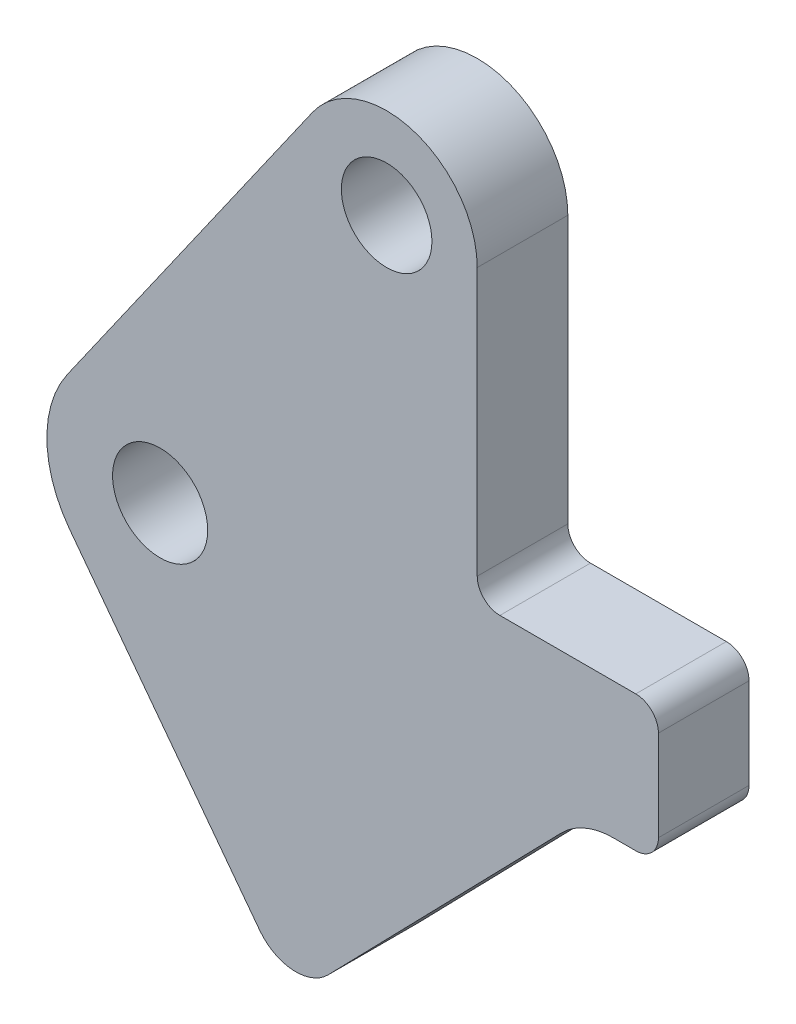
ISO-10303-21;
HEADER;
FILE_DESCRIPTION(('STEP AP214'),'2;1');
FILE_NAME('part.step','',(''),(''),'','','');
FILE_SCHEMA(('AUTOMOTIVE_DESIGN { 1 0 10303 214 1 1 1 1 }'));
ENDSEC;
DATA;
#1=APPLICATION_CONTEXT('core data for automotive mechanical design processes');
#2=APPLICATION_PROTOCOL_DEFINITION('international standard','automotive_design',2000,#1);
#3=PRODUCT_CONTEXT('',#1,'mechanical');
#4=PRODUCT('Part','Part','',(#3));
#5=PRODUCT_RELATED_PRODUCT_CATEGORY('part','',(#4));
#6=PRODUCT_DEFINITION_FORMATION('','',#4);
#7=PRODUCT_DEFINITION_CONTEXT('part definition',#1,'design');
#8=PRODUCT_DEFINITION('design','',#6,#7);
#9=PRODUCT_DEFINITION_SHAPE('','',#8);
#10=(LENGTH_UNIT() NAMED_UNIT(*) SI_UNIT(.MILLI.,.METRE.));
#11=(NAMED_UNIT(*) PLANE_ANGLE_UNIT() SI_UNIT($,.RADIAN.));
#12=(NAMED_UNIT(*) SI_UNIT($,.STERADIAN.) SOLID_ANGLE_UNIT());
#13=UNCERTAINTY_MEASURE_WITH_UNIT(LENGTH_MEASURE(1.E-05),#10,'distance_accuracy_value','');
#14=(GEOMETRIC_REPRESENTATION_CONTEXT(3) GLOBAL_UNCERTAINTY_ASSIGNED_CONTEXT((#13)) GLOBAL_UNIT_ASSIGNED_CONTEXT((#10,
#11,#12)) REPRESENTATION_CONTEXT('',''));
#15=CARTESIAN_POINT('',(0.,0.,0.));
#16=DIRECTION('',(0.,0.,1.));
#17=DIRECTION('',(1.,0.,0.));
#18=AXIS2_PLACEMENT_3D('',#15,#16,#17);
#19=CARTESIAN_POINT('',(0.,0.,2.));
#20=DIRECTION('',(0.,0.,1.));
#21=DIRECTION('',(1.,0.,0.));
#22=AXIS2_PLACEMENT_3D('',#19,#20,#21);
#23=PLANE('',#22);
#24=CARTESIAN_POINT('',(0.,0.,2.));
#25=DIRECTION('',(0.,0.,1.));
#26=DIRECTION('',(1.,0.,0.));
#27=AXIS2_PLACEMENT_3D('',#24,#25,#26);
#28=CIRCLE('',#27,1.05);
#29=CARTESIAN_POINT('',(1.05,0.,2.));
#30=VERTEX_POINT('',#29);
#31=EDGE_CURVE('E171',#30,#30,#28,.T.);
#32=ORIENTED_EDGE('',*,*,#31,.F.);
#33=EDGE_LOOP('',(#32));
#34=FACE_BOUND('',#33,.T.);
#35=CARTESIAN_POINT('',(0.,0.,2.));
#36=DIRECTION('',(0.,0.,1.));
#37=DIRECTION('',(1.,0.,0.));
#38=AXIS2_PLACEMENT_3D('',#35,#36,#37);
#39=CIRCLE('',#38,2.5);
#40=CARTESIAN_POINT('',(-2.04679142487829,1.43549464054893,2.));
#41=VERTEX_POINT('',#40);
#42=CARTESIAN_POINT('',(-1.99658877511824,-1.50453755788012,2.));
#43=VERTEX_POINT('',#42);
#44=EDGE_CURVE('E194',#41,#43,#39,.T.);
#45=ORIENTED_EDGE('',*,*,#44,.T.);
#46=DIRECTION('',(0.601815023152047,-0.798635510047294,0.));
#47=VECTOR('',#46,1.);
#48=CARTESIAN_POINT('',(-1.99658877511824,-1.50453755788012,2.));
#49=LINE('',#48,#47);
#50=CARTESIAN_POINT('',(2.1964101178715,-7.06883502588228,2.));
#51=VERTEX_POINT('',#50);
#52=EDGE_CURVE('E112',#43,#51,#49,.T.);
#53=ORIENTED_EDGE('',*,*,#52,.T.);
#54=CARTESIAN_POINT('',(2.99504562791879,-6.46702000273023,2.));
#55=DIRECTION('',(0.,0.,1.));
#56=DIRECTION('',(1.,0.,0.));
#57=AXIS2_PLACEMENT_3D('',#54,#55,#56);
#58=CIRCLE('',#57,1.);
#59=CARTESIAN_POINT('',(3.71149817182193,-7.16465583347198,2.));
#60=VERTEX_POINT('',#59);
#61=EDGE_CURVE('E227',#51,#60,#58,.T.);
#62=ORIENTED_EDGE('',*,*,#61,.T.);
#63=DIRECTION('',(0.697635830741747,0.716452543903134,0.));
#64=VECTOR('',#63,1.);
#65=CARTESIAN_POINT('',(3.71149817182193,-7.16465583347198,2.));
#66=LINE('',#65,#64);
#67=CARTESIAN_POINT('',(8.85367592975498,-1.8837826708132,2.));
#68=VERTEX_POINT('',#67);
#69=EDGE_CURVE('E246',#60,#68,#66,.T.);
#70=ORIENTED_EDGE('',*,*,#69,.T.);
#71=CARTESIAN_POINT('',(10.,-3.,2.));
#72=DIRECTION('',(0.,0.,-1.));
#73=DIRECTION('',(1.,0.,0.));
#74=AXIS2_PLACEMENT_3D('',#71,#72,#73);
#75=CIRCLE('',#74,1.6);
#76=CARTESIAN_POINT('',(10.,-1.4,2.));
#77=VERTEX_POINT('',#76);
#78=EDGE_CURVE('E243',#68,#77,#75,.T.);
#79=ORIENTED_EDGE('',*,*,#78,.T.);
#80=DIRECTION('',(1.,0.,0.));
#81=VECTOR('',#80,1.);
#82=CARTESIAN_POINT('',(10.,-1.4,2.));
#83=LINE('',#82,#81);
#84=CARTESIAN_POINT('',(10.5,-1.4,2.));
#85=VERTEX_POINT('',#84);
#86=EDGE_CURVE('E245',#77,#85,#83,.T.);
#87=ORIENTED_EDGE('',*,*,#86,.T.);
#88=CARTESIAN_POINT('',(10.5,-0.9,2.));
#89=DIRECTION('',(0.,0.,1.));
#90=DIRECTION('',(1.,0.,0.));
#91=AXIS2_PLACEMENT_3D('',#88,#89,#90);
#92=CIRCLE('',#91,0.5);
#93=CARTESIAN_POINT('',(11.,-0.9,2.));
#94=VERTEX_POINT('',#93);
#95=EDGE_CURVE('E248',#85,#94,#92,.T.);
#96=ORIENTED_EDGE('',*,*,#95,.T.);
#97=DIRECTION('',(0.,1.,0.));
#98=VECTOR('',#97,1.);
#99=CARTESIAN_POINT('',(11.,-0.9,2.));
#100=LINE('',#99,#98);
#101=CARTESIAN_POINT('',(11.,1.1,2.));
#102=VERTEX_POINT('',#101);
#103=EDGE_CURVE('E254',#94,#102,#100,.T.);
#104=ORIENTED_EDGE('',*,*,#103,.T.);
#105=CARTESIAN_POINT('',(10.5,1.1,2.));
#106=DIRECTION('',(0.,0.,1.));
#107=DIRECTION('',(1.,0.,0.));
#108=AXIS2_PLACEMENT_3D('',#105,#106,#107);
#109=CIRCLE('',#108,0.5);
#110=CARTESIAN_POINT('',(10.5,1.6,2.));
#111=VERTEX_POINT('',#110);
#112=EDGE_CURVE('E256',#102,#111,#109,.T.);
#113=ORIENTED_EDGE('',*,*,#112,.T.);
#114=DIRECTION('',(-1.,0.,0.));
#115=VECTOR('',#114,1.);
#116=CARTESIAN_POINT('',(7.5,1.6,2.));
#117=LINE('',#116,#115);
#118=CARTESIAN_POINT('',(7.5,1.6,2.));
#119=VERTEX_POINT('',#118);
#120=EDGE_CURVE('E258',#111,#119,#117,.T.);
#121=ORIENTED_EDGE('',*,*,#120,.T.);
#122=CARTESIAN_POINT('',(7.5,2.1,2.));
#123=DIRECTION('',(0.,0.,-1.));
#124=DIRECTION('',(1.,0.,0.));
#125=AXIS2_PLACEMENT_3D('',#122,#123,#124);
#126=CIRCLE('',#125,0.5);
#127=CARTESIAN_POINT('',(7.,2.1,2.));
#128=VERTEX_POINT('',#127);
#129=EDGE_CURVE('E149',#119,#128,#126,.T.);
#130=ORIENTED_EDGE('',*,*,#129,.T.);
#131=DIRECTION('',(0.,1.,0.));
#132=VECTOR('',#131,1.);
#133=CARTESIAN_POINT('',(7.,8.,2.));
#134=LINE('',#133,#132);
#135=CARTESIAN_POINT('',(7.,8.,2.));
#136=VERTEX_POINT('',#135);
#137=EDGE_CURVE('E143',#128,#136,#134,.T.);
#138=ORIENTED_EDGE('',*,*,#137,.T.);
#139=CARTESIAN_POINT('',(5.,8.,2.));
#140=DIRECTION('',(0.,0.,1.));
#141=DIRECTION('',(-1.,0.,0.));
#142=AXIS2_PLACEMENT_3D('',#139,#140,#141);
#143=CIRCLE('',#142,2.);
#144=CARTESIAN_POINT('',(3.36256686009737,9.14839571243914,2.));
#145=VERTEX_POINT('',#144);
#146=EDGE_CURVE('E147',#136,#145,#143,.T.);
#147=ORIENTED_EDGE('',*,*,#146,.T.);
#148=DIRECTION('',(-0.574197856219572,-0.818716569951315,0.));
#149=VECTOR('',#148,1.);
#150=CARTESIAN_POINT('',(3.36256686009737,9.14839571243914,2.));
#151=LINE('',#150,#149);
#152=EDGE_CURVE('E51',#145,#41,#151,.T.);
#153=ORIENTED_EDGE('',*,*,#152,.T.);
#154=EDGE_LOOP('',(#45,#53,#62,#70,#79,#87,#96,#104,#113,#121,#130,#138,#147,#153));
#155=FACE_BOUND('',#154,.T.);
#156=CARTESIAN_POINT('',(5.,8.,2.));
#157=DIRECTION('',(0.,0.,1.));
#158=DIRECTION('',(1.,0.,0.));
#159=AXIS2_PLACEMENT_3D('',#156,#157,#158);
#160=CIRCLE('',#159,1.);
#161=CARTESIAN_POINT('',(6.,8.,2.));
#162=VERTEX_POINT('',#161);
#163=EDGE_CURVE('E300',#162,#162,#160,.T.);
#164=ORIENTED_EDGE('',*,*,#163,.F.);
#165=EDGE_LOOP('',(#164));
#166=FACE_BOUND('',#165,.T.);
#167=ADVANCED_FACE('F34',(#34,#155,#166),#23,.T.);
#168=CARTESIAN_POINT('',(0.,0.,0.));
#169=DIRECTION('',(0.,0.,1.));
#170=DIRECTION('',(1.,0.,0.));
#171=AXIS2_PLACEMENT_3D('',#168,#169,#170);
#172=PLANE('',#171);
#173=CARTESIAN_POINT('',(0.,0.,0.));
#174=DIRECTION('',(0.,0.,1.));
#175=DIRECTION('',(1.,0.,0.));
#176=AXIS2_PLACEMENT_3D('',#173,#174,#175);
#177=CIRCLE('',#176,2.5);
#178=CARTESIAN_POINT('',(-2.04679142487829,1.43549464054893,0.));
#179=VERTEX_POINT('',#178);
#180=CARTESIAN_POINT('',(-1.99658877511824,-1.50453755788012,0.));
#181=VERTEX_POINT('',#180);
#182=EDGE_CURVE('E167',#179,#181,#177,.T.);
#183=ORIENTED_EDGE('',*,*,#182,.F.);
#184=DIRECTION('',(-0.574197856219572,-0.818716569951315,0.));
#185=VECTOR('',#184,1.);
#186=CARTESIAN_POINT('',(3.36256686009737,9.14839571243914,0.));
#187=LINE('',#186,#185);
#188=CARTESIAN_POINT('',(3.36256686009737,9.14839571243914,0.));
#189=VERTEX_POINT('',#188);
#190=EDGE_CURVE('E104',#189,#179,#187,.T.);
#191=ORIENTED_EDGE('',*,*,#190,.F.);
#192=CARTESIAN_POINT('',(5.,8.,0.));
#193=DIRECTION('',(0.,0.,1.));
#194=DIRECTION('',(-1.,0.,0.));
#195=AXIS2_PLACEMENT_3D('',#192,#193,#194);
#196=CIRCLE('',#195,2.);
#197=CARTESIAN_POINT('',(7.,8.,0.));
#198=VERTEX_POINT('',#197);
#199=EDGE_CURVE('E98',#198,#189,#196,.T.);
#200=ORIENTED_EDGE('',*,*,#199,.F.);
#201=DIRECTION('',(0.,1.,0.));
#202=VECTOR('',#201,1.);
#203=CARTESIAN_POINT('',(7.,8.,0.));
#204=LINE('',#203,#202);
#205=CARTESIAN_POINT('',(7.,2.1,0.));
#206=VERTEX_POINT('',#205);
#207=EDGE_CURVE('E157',#206,#198,#204,.T.);
#208=ORIENTED_EDGE('',*,*,#207,.F.);
#209=CARTESIAN_POINT('',(7.5,2.1,0.));
#210=DIRECTION('',(0.,0.,-1.));
#211=DIRECTION('',(1.,0.,0.));
#212=AXIS2_PLACEMENT_3D('',#209,#210,#211);
#213=CIRCLE('',#212,0.5);
#214=CARTESIAN_POINT('',(7.5,1.6,0.));
#215=VERTEX_POINT('',#214);
#216=EDGE_CURVE('E189',#215,#206,#213,.T.);
#217=ORIENTED_EDGE('',*,*,#216,.F.);
#218=DIRECTION('',(-1.,0.,0.));
#219=VECTOR('',#218,1.);
#220=CARTESIAN_POINT('',(7.5,1.6,0.));
#221=LINE('',#220,#219);
#222=CARTESIAN_POINT('',(10.5,1.6,0.));
#223=VERTEX_POINT('',#222);
#224=EDGE_CURVE('E187',#223,#215,#221,.T.);
#225=ORIENTED_EDGE('',*,*,#224,.F.);
#226=CARTESIAN_POINT('',(10.5,1.1,0.));
#227=DIRECTION('',(0.,0.,1.));
#228=DIRECTION('',(1.,0.,0.));
#229=AXIS2_PLACEMENT_3D('',#226,#227,#228);
#230=CIRCLE('',#229,0.5);
#231=CARTESIAN_POINT('',(11.,1.1,0.));
#232=VERTEX_POINT('',#231);
#233=EDGE_CURVE('E185',#232,#223,#230,.T.);
#234=ORIENTED_EDGE('',*,*,#233,.F.);
#235=DIRECTION('',(0.,1.,0.));
#236=VECTOR('',#235,1.);
#237=CARTESIAN_POINT('',(11.,-0.9,0.));
#238=LINE('',#237,#236);
#239=CARTESIAN_POINT('',(11.,-0.9,0.));
#240=VERTEX_POINT('',#239);
#241=EDGE_CURVE('E183',#240,#232,#238,.T.);
#242=ORIENTED_EDGE('',*,*,#241,.F.);
#243=CARTESIAN_POINT('',(10.5,-0.9,0.));
#244=DIRECTION('',(0.,0.,1.));
#245=DIRECTION('',(1.,0.,0.));
#246=AXIS2_PLACEMENT_3D('',#243,#244,#245);
#247=CIRCLE('',#246,0.5);
#248=CARTESIAN_POINT('',(10.5,-1.4,0.));
#249=VERTEX_POINT('',#248);
#250=EDGE_CURVE('E181',#249,#240,#247,.T.);
#251=ORIENTED_EDGE('',*,*,#250,.F.);
#252=DIRECTION('',(1.,0.,0.));
#253=VECTOR('',#252,1.);
#254=CARTESIAN_POINT('',(10.,-1.4,0.));
#255=LINE('',#254,#253);
#256=CARTESIAN_POINT('',(10.,-1.4,0.));
#257=VERTEX_POINT('',#256);
#258=EDGE_CURVE('E179',#257,#249,#255,.T.);
#259=ORIENTED_EDGE('',*,*,#258,.F.);
#260=CARTESIAN_POINT('',(10.,-3.,0.));
#261=DIRECTION('',(0.,0.,-1.));
#262=DIRECTION('',(1.,0.,0.));
#263=AXIS2_PLACEMENT_3D('',#260,#261,#262);
#264=CIRCLE('',#263,1.6);
#265=CARTESIAN_POINT('',(8.85367592975498,-1.8837826708132,0.));
#266=VERTEX_POINT('',#265);
#267=EDGE_CURVE('E177',#266,#257,#264,.T.);
#268=ORIENTED_EDGE('',*,*,#267,.F.);
#269=DIRECTION('',(0.697635830741747,0.716452543903134,0.));
#270=VECTOR('',#269,1.);
#271=CARTESIAN_POINT('',(3.71149817182193,-7.16465583347198,0.));
#272=LINE('',#271,#270);
#273=CARTESIAN_POINT('',(3.71149817182193,-7.16465583347198,0.));
#274=VERTEX_POINT('',#273);
#275=EDGE_CURVE('E175',#274,#266,#272,.T.);
#276=ORIENTED_EDGE('',*,*,#275,.F.);
#277=CARTESIAN_POINT('',(2.99504562791879,-6.46702000273023,0.));
#278=DIRECTION('',(0.,0.,1.));
#279=DIRECTION('',(1.,0.,0.));
#280=AXIS2_PLACEMENT_3D('',#277,#278,#279);
#281=CIRCLE('',#280,1.);
#282=CARTESIAN_POINT('',(2.1964101178715,-7.06883502588228,0.));
#283=VERTEX_POINT('',#282);
#284=EDGE_CURVE('E173',#283,#274,#281,.T.);
#285=ORIENTED_EDGE('',*,*,#284,.F.);
#286=DIRECTION('',(0.601815023152047,-0.798635510047294,0.));
#287=VECTOR('',#286,1.);
#288=CARTESIAN_POINT('',(-1.99658877511824,-1.50453755788012,0.));
#289=LINE('',#288,#287);
#290=EDGE_CURVE('E170',#181,#283,#289,.T.);
#291=ORIENTED_EDGE('',*,*,#290,.F.);
#292=EDGE_LOOP('',(#183,#191,#200,#208,#217,#225,#234,#242,#251,#259,#268,#276,#285,#291));
#293=FACE_BOUND('',#292,.T.);
#294=CARTESIAN_POINT('',(0.,0.,0.));
#295=DIRECTION('',(0.,0.,1.));
#296=DIRECTION('',(1.,0.,0.));
#297=AXIS2_PLACEMENT_3D('',#294,#295,#296);
#298=CIRCLE('',#297,1.05);
#299=CARTESIAN_POINT('',(1.05,0.,0.));
#300=VERTEX_POINT('',#299);
#301=EDGE_CURVE('E306',#300,#300,#298,.T.);
#302=ORIENTED_EDGE('',*,*,#301,.T.);
#303=EDGE_LOOP('',(#302));
#304=FACE_BOUND('',#303,.T.);
#305=CARTESIAN_POINT('',(5.,8.,0.));
#306=DIRECTION('',(0.,0.,1.));
#307=DIRECTION('',(1.,0.,0.));
#308=AXIS2_PLACEMENT_3D('',#305,#306,#307);
#309=CIRCLE('',#308,1.);
#310=CARTESIAN_POINT('',(6.,8.,0.));
#311=VERTEX_POINT('',#310);
#312=EDGE_CURVE('E303',#311,#311,#309,.T.);
#313=ORIENTED_EDGE('',*,*,#312,.T.);
#314=EDGE_LOOP('',(#313));
#315=FACE_BOUND('',#314,.T.);
#316=ADVANCED_FACE('F231',(#293,#304,#315),#172,.F.);
#317=CARTESIAN_POINT('',(0.,0.,2.));
#318=DIRECTION('',(0.,0.,-1.));
#319=DIRECTION('',(-1.,0.,0.));
#320=AXIS2_PLACEMENT_3D('',#317,#318,#319);
#321=CYLINDRICAL_SURFACE('',#320,2.5);
#322=ORIENTED_EDGE('',*,*,#182,.T.);
#323=DIRECTION('',(0.,0.,-1.));
#324=VECTOR('',#323,1.);
#325=CARTESIAN_POINT('',(-1.99658877511824,-1.50453755788012,2.));
#326=LINE('',#325,#324);
#327=EDGE_CURVE('E11',#43,#181,#326,.T.);
#328=ORIENTED_EDGE('',*,*,#327,.F.);
#329=ORIENTED_EDGE('',*,*,#44,.F.);
#330=DIRECTION('',(0.,0.,-1.));
#331=VECTOR('',#330,1.);
#332=CARTESIAN_POINT('',(-2.04679142487829,1.43549464054893,2.));
#333=LINE('',#332,#331);
#334=EDGE_CURVE('E163',#41,#179,#333,.T.);
#335=ORIENTED_EDGE('',*,*,#334,.T.);
#336=EDGE_LOOP('',(#322,#328,#329,#335));
#337=FACE_BOUND('',#336,.T.);
#338=ADVANCED_FACE('F36',(#337),#321,.T.);
#339=CARTESIAN_POINT('',(-1.99658877511824,-1.50453755788012,2.));
#340=DIRECTION('',(0.798635510047294,0.601815023152047,0.));
#341=DIRECTION('',(-0.601815023152047,0.798635510047294,0.));
#342=AXIS2_PLACEMENT_3D('',#339,#340,#341);
#343=PLANE('',#342);
#344=ORIENTED_EDGE('',*,*,#290,.T.);
#345=DIRECTION('',(0.,0.,-1.));
#346=VECTOR('',#345,1.);
#347=CARTESIAN_POINT('',(2.1964101178715,-7.06883502588228,2.));
#348=LINE('',#347,#346);
#349=EDGE_CURVE('E43',#51,#283,#348,.T.);
#350=ORIENTED_EDGE('',*,*,#349,.F.);
#351=ORIENTED_EDGE('',*,*,#52,.F.);
#352=ORIENTED_EDGE('',*,*,#327,.T.);
#353=EDGE_LOOP('',(#344,#350,#351,#352));
#354=FACE_BOUND('',#353,.T.);
#355=ADVANCED_FACE('F419',(#354),#343,.F.);
#356=CARTESIAN_POINT('',(2.99504562791879,-6.46702000273023,2.));
#357=DIRECTION('',(0.,0.,-1.));
#358=DIRECTION('',(-1.,0.,0.));
#359=AXIS2_PLACEMENT_3D('',#356,#357,#358);
#360=CYLINDRICAL_SURFACE('',#359,1.);
#361=ORIENTED_EDGE('',*,*,#284,.T.);
#362=DIRECTION('',(0.,0.,-1.));
#363=VECTOR('',#362,1.);
#364=CARTESIAN_POINT('',(3.71149817182193,-7.16465583347198,2.));
#365=LINE('',#364,#363);
#366=EDGE_CURVE('E219',#60,#274,#365,.T.);
#367=ORIENTED_EDGE('',*,*,#366,.F.);
#368=ORIENTED_EDGE('',*,*,#61,.F.);
#369=ORIENTED_EDGE('',*,*,#349,.T.);
#370=EDGE_LOOP('',(#361,#367,#368,#369));
#371=FACE_BOUND('',#370,.T.);
#372=ADVANCED_FACE('F225',(#371),#360,.T.);
#373=CARTESIAN_POINT('',(3.71149817182193,-7.16465583347198,2.));
#374=DIRECTION('',(-0.716452543903135,0.697635830741747,0.));
#375=DIRECTION('',(-0.697635830741747,-0.716452543903135,0.));
#376=AXIS2_PLACEMENT_3D('',#373,#374,#375);
#377=PLANE('',#376);
#378=ORIENTED_EDGE('',*,*,#275,.T.);
#379=DIRECTION('',(0.,0.,-1.));
#380=VECTOR('',#379,1.);
#381=CARTESIAN_POINT('',(8.85367592975498,-1.8837826708132,2.));
#382=LINE('',#381,#380);
#383=EDGE_CURVE('E216',#68,#266,#382,.T.);
#384=ORIENTED_EDGE('',*,*,#383,.F.);
#385=ORIENTED_EDGE('',*,*,#69,.F.);
#386=ORIENTED_EDGE('',*,*,#366,.T.);
#387=EDGE_LOOP('',(#378,#384,#385,#386));
#388=FACE_BOUND('',#387,.T.);
#389=ADVANCED_FACE('F237',(#388),#377,.F.);
#390=CARTESIAN_POINT('',(10.,-3.,2.));
#391=DIRECTION('',(0.,0.,-1.));
#392=DIRECTION('',(-1.,0.,0.));
#393=AXIS2_PLACEMENT_3D('',#390,#391,#392);
#394=CYLINDRICAL_SURFACE('',#393,1.6);
#395=ORIENTED_EDGE('',*,*,#267,.T.);
#396=DIRECTION('',(0.,0.,-1.));
#397=VECTOR('',#396,1.);
#398=CARTESIAN_POINT('',(10.,-1.4,2.));
#399=LINE('',#398,#397);
#400=EDGE_CURVE('E213',#77,#257,#399,.T.);
#401=ORIENTED_EDGE('',*,*,#400,.F.);
#402=ORIENTED_EDGE('',*,*,#78,.F.);
#403=ORIENTED_EDGE('',*,*,#383,.T.);
#404=EDGE_LOOP('',(#395,#401,#402,#403));
#405=FACE_BOUND('',#404,.T.);
#406=ADVANCED_FACE('F241',(#405),#394,.F.);
#407=CARTESIAN_POINT('',(10.,-1.4,2.));
#408=DIRECTION('',(0.,1.,0.));
#409=DIRECTION('',(-1.,0.,0.));
#410=AXIS2_PLACEMENT_3D('',#407,#408,#409);
#411=PLANE('',#410);
#412=ORIENTED_EDGE('',*,*,#258,.T.);
#413=DIRECTION('',(0.,0.,-1.));
#414=VECTOR('',#413,1.);
#415=CARTESIAN_POINT('',(10.5,-1.4,2.));
#416=LINE('',#415,#414);
#417=EDGE_CURVE('E210',#85,#249,#416,.T.);
#418=ORIENTED_EDGE('',*,*,#417,.F.);
#419=ORIENTED_EDGE('',*,*,#86,.F.);
#420=ORIENTED_EDGE('',*,*,#400,.T.);
#421=EDGE_LOOP('',(#412,#418,#419,#420));
#422=FACE_BOUND('',#421,.T.);
#423=ADVANCED_FACE('F384',(#422),#411,.F.);
#424=CARTESIAN_POINT('',(10.5,-0.9,2.));
#425=DIRECTION('',(0.,0.,-1.));
#426=DIRECTION('',(-1.,0.,0.));
#427=AXIS2_PLACEMENT_3D('',#424,#425,#426);
#428=CYLINDRICAL_SURFACE('',#427,0.5);
#429=ORIENTED_EDGE('',*,*,#250,.T.);
#430=DIRECTION('',(0.,0.,-1.));
#431=VECTOR('',#430,1.);
#432=CARTESIAN_POINT('',(11.,-0.9,2.));
#433=LINE('',#432,#431);
#434=EDGE_CURVE('E207',#94,#240,#433,.T.);
#435=ORIENTED_EDGE('',*,*,#434,.F.);
#436=ORIENTED_EDGE('',*,*,#95,.F.);
#437=ORIENTED_EDGE('',*,*,#417,.T.);
#438=EDGE_LOOP('',(#429,#435,#436,#437));
#439=FACE_BOUND('',#438,.T.);
#440=ADVANCED_FACE('F374',(#439),#428,.T.);
#441=CARTESIAN_POINT('',(11.,-0.9,2.));
#442=DIRECTION('',(-1.,0.,0.));
#443=DIRECTION('',(0.,0.,1.));
#444=AXIS2_PLACEMENT_3D('',#441,#442,#443);
#445=PLANE('',#444);
#446=ORIENTED_EDGE('',*,*,#241,.T.);
#447=DIRECTION('',(0.,0.,-1.));
#448=VECTOR('',#447,1.);
#449=CARTESIAN_POINT('',(11.,1.1,2.));
#450=LINE('',#449,#448);
#451=EDGE_CURVE('E204',#102,#232,#450,.T.);
#452=ORIENTED_EDGE('',*,*,#451,.F.);
#453=ORIENTED_EDGE('',*,*,#103,.F.);
#454=ORIENTED_EDGE('',*,*,#434,.T.);
#455=EDGE_LOOP('',(#446,#452,#453,#454));
#456=FACE_BOUND('',#455,.T.);
#457=ADVANCED_FACE('F364',(#456),#445,.F.);
#458=CARTESIAN_POINT('',(10.5,1.1,2.));
#459=DIRECTION('',(0.,0.,-1.));
#460=DIRECTION('',(-1.,0.,0.));
#461=AXIS2_PLACEMENT_3D('',#458,#459,#460);
#462=CYLINDRICAL_SURFACE('',#461,0.5);
#463=ORIENTED_EDGE('',*,*,#233,.T.);
#464=DIRECTION('',(0.,0.,-1.));
#465=VECTOR('',#464,1.);
#466=CARTESIAN_POINT('',(10.5,1.6,2.));
#467=LINE('',#466,#465);
#468=EDGE_CURVE('E201',#111,#223,#467,.T.);
#469=ORIENTED_EDGE('',*,*,#468,.F.);
#470=ORIENTED_EDGE('',*,*,#112,.F.);
#471=ORIENTED_EDGE('',*,*,#451,.T.);
#472=EDGE_LOOP('',(#463,#469,#470,#471));
#473=FACE_BOUND('',#472,.T.);
#474=ADVANCED_FACE('F355',(#473),#462,.T.);
#475=CARTESIAN_POINT('',(7.5,1.6,2.));
#476=DIRECTION('',(0.,-1.,0.));
#477=DIRECTION('',(1.,0.,0.));
#478=AXIS2_PLACEMENT_3D('',#475,#476,#477);
#479=PLANE('',#478);
#480=ORIENTED_EDGE('',*,*,#224,.T.);
#481=DIRECTION('',(0.,0.,-1.));
#482=VECTOR('',#481,1.);
#483=CARTESIAN_POINT('',(7.5,1.6,2.));
#484=LINE('',#483,#482);
#485=EDGE_CURVE('E198',#119,#215,#484,.T.);
#486=ORIENTED_EDGE('',*,*,#485,.F.);
#487=ORIENTED_EDGE('',*,*,#120,.F.);
#488=ORIENTED_EDGE('',*,*,#468,.T.);
#489=EDGE_LOOP('',(#480,#486,#487,#488));
#490=FACE_BOUND('',#489,.T.);
#491=ADVANCED_FACE('F264',(#490),#479,.F.);
#492=CARTESIAN_POINT('',(7.5,2.1,2.));
#493=DIRECTION('',(0.,0.,-1.));
#494=DIRECTION('',(-1.,0.,0.));
#495=AXIS2_PLACEMENT_3D('',#492,#493,#494);
#496=CYLINDRICAL_SURFACE('',#495,0.5);
#497=ORIENTED_EDGE('',*,*,#216,.T.);
#498=DIRECTION('',(0.,0.,-1.));
#499=VECTOR('',#498,1.);
#500=CARTESIAN_POINT('',(7.,2.1,2.));
#501=LINE('',#500,#499);
#502=EDGE_CURVE('E158',#128,#206,#501,.T.);
#503=ORIENTED_EDGE('',*,*,#502,.F.);
#504=ORIENTED_EDGE('',*,*,#129,.F.);
#505=ORIENTED_EDGE('',*,*,#485,.T.);
#506=EDGE_LOOP('',(#497,#503,#504,#505));
#507=FACE_BOUND('',#506,.T.);
#508=ADVANCED_FACE('F268',(#507),#496,.F.);
#509=CARTESIAN_POINT('',(7.,8.,2.));
#510=DIRECTION('',(-1.,0.,0.));
#511=DIRECTION('',(0.,0.,1.));
#512=AXIS2_PLACEMENT_3D('',#509,#510,#511);
#513=PLANE('',#512);
#514=ORIENTED_EDGE('',*,*,#207,.T.);
#515=DIRECTION('',(0.,0.,-1.));
#516=VECTOR('',#515,1.);
#517=CARTESIAN_POINT('',(7.,8.,2.));
#518=LINE('',#517,#516);
#519=EDGE_CURVE('E154',#136,#198,#518,.T.);
#520=ORIENTED_EDGE('',*,*,#519,.F.);
#521=ORIENTED_EDGE('',*,*,#137,.F.);
#522=ORIENTED_EDGE('',*,*,#502,.T.);
#523=EDGE_LOOP('',(#514,#520,#521,#522));
#524=FACE_BOUND('',#523,.T.);
#525=ADVANCED_FACE('F155',(#524),#513,.F.);
#526=CARTESIAN_POINT('',(5.,8.,2.));
#527=DIRECTION('',(0.,0.,-1.));
#528=DIRECTION('',(-1.,0.,0.));
#529=AXIS2_PLACEMENT_3D('',#526,#527,#528);
#530=CYLINDRICAL_SURFACE('',#529,2.);
#531=ORIENTED_EDGE('',*,*,#199,.T.);
#532=DIRECTION('',(0.,0.,-1.));
#533=VECTOR('',#532,1.);
#534=CARTESIAN_POINT('',(3.36256686009737,9.14839571243914,2.));
#535=LINE('',#534,#533);
#536=EDGE_CURVE('E159',#145,#189,#535,.T.);
#537=ORIENTED_EDGE('',*,*,#536,.F.);
#538=ORIENTED_EDGE('',*,*,#146,.F.);
#539=ORIENTED_EDGE('',*,*,#519,.T.);
#540=EDGE_LOOP('',(#531,#537,#538,#539));
#541=FACE_BOUND('',#540,.T.);
#542=ADVANCED_FACE('F161',(#541),#530,.T.);
#543=CARTESIAN_POINT('',(3.36256686009737,9.14839571243914,2.));
#544=DIRECTION('',(0.818716569951316,-0.574197856219572,0.));
#545=DIRECTION('',(0.574197856219572,0.818716569951315,0.));
#546=AXIS2_PLACEMENT_3D('',#543,#544,#545);
#547=PLANE('',#546);
#548=ORIENTED_EDGE('',*,*,#190,.T.);
#549=ORIENTED_EDGE('',*,*,#334,.F.);
#550=ORIENTED_EDGE('',*,*,#152,.F.);
#551=ORIENTED_EDGE('',*,*,#536,.T.);
#552=EDGE_LOOP('',(#548,#549,#550,#551));
#553=FACE_BOUND('',#552,.T.);
#554=ADVANCED_FACE('F272',(#553),#547,.F.);
#555=CARTESIAN_POINT('',(0.,0.,2.));
#556=DIRECTION('',(0.,0.,-1.));
#557=DIRECTION('',(-1.,0.,0.));
#558=AXIS2_PLACEMENT_3D('',#555,#556,#557);
#559=CYLINDRICAL_SURFACE('',#558,1.05);
#560=ORIENTED_EDGE('',*,*,#31,.T.);
#561=EDGE_LOOP('',(#560));
#562=FACE_BOUND('',#561,.T.);
#563=ORIENTED_EDGE('',*,*,#301,.F.);
#564=EDGE_LOOP('',(#563));
#565=FACE_BOUND('',#564,.T.);
#566=ADVANCED_FACE('F274',(#562,#565),#559,.F.);
#567=CARTESIAN_POINT('',(5.,8.,2.));
#568=DIRECTION('',(0.,0.,-1.));
#569=DIRECTION('',(-1.,0.,0.));
#570=AXIS2_PLACEMENT_3D('',#567,#568,#569);
#571=CYLINDRICAL_SURFACE('',#570,1.);
#572=ORIENTED_EDGE('',*,*,#163,.T.);
#573=EDGE_LOOP('',(#572));
#574=FACE_BOUND('',#573,.T.);
#575=ORIENTED_EDGE('',*,*,#312,.F.);
#576=EDGE_LOOP('',(#575));
#577=FACE_BOUND('',#576,.T.);
#578=ADVANCED_FACE('F280',(#574,#577),#571,.F.);
#579=CLOSED_SHELL('',(#167,#316,#338,#355,#372,#389,#406,#423,#440,#457,#474,#491,#508,#525,
#542,#554,#566,#578));
#580=MANIFOLD_SOLID_BREP('B2',#579);
#581=ADVANCED_BREP_SHAPE_REPRESENTATION('',(#18,#580),#14);
#582=SHAPE_DEFINITION_REPRESENTATION(#9,#581);
ENDSEC;
END-ISO-10303-21;
